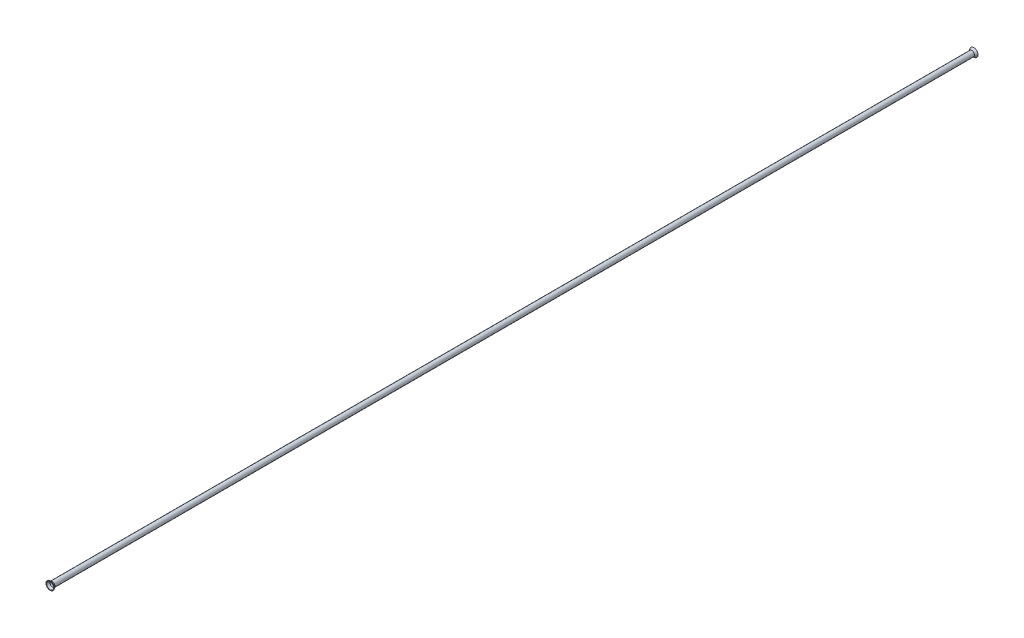
ISO-10303-21;
HEADER;
FILE_DESCRIPTION(('STEP AP214'),'2;1');
FILE_NAME('part.step','',(''),(''),'','','');
FILE_SCHEMA(('AUTOMOTIVE_DESIGN { 1 0 10303 214 1 1 1 1 }'));
ENDSEC;
DATA;
#1=APPLICATION_CONTEXT('core data for automotive mechanical design processes');
#2=APPLICATION_PROTOCOL_DEFINITION('international standard','automotive_design',2000,#1);
#3=PRODUCT_CONTEXT('',#1,'mechanical');
#4=PRODUCT('Part','Part','',(#3));
#5=PRODUCT_RELATED_PRODUCT_CATEGORY('part','',(#4));
#6=PRODUCT_DEFINITION_FORMATION('','',#4);
#7=PRODUCT_DEFINITION_CONTEXT('part definition',#1,'design');
#8=PRODUCT_DEFINITION('design','',#6,#7);
#9=PRODUCT_DEFINITION_SHAPE('','',#8);
#10=(LENGTH_UNIT() NAMED_UNIT(*) SI_UNIT(.MILLI.,.METRE.));
#11=(NAMED_UNIT(*) PLANE_ANGLE_UNIT() SI_UNIT($,.RADIAN.));
#12=(NAMED_UNIT(*) SI_UNIT($,.STERADIAN.) SOLID_ANGLE_UNIT());
#13=UNCERTAINTY_MEASURE_WITH_UNIT(LENGTH_MEASURE(1.E-05),#10,'distance_accuracy_value','');
#14=(GEOMETRIC_REPRESENTATION_CONTEXT(3) GLOBAL_UNCERTAINTY_ASSIGNED_CONTEXT((#13)) GLOBAL_UNIT_ASSIGNED_CONTEXT((#10,
#11,#12)) REPRESENTATION_CONTEXT('',''));
#15=CARTESIAN_POINT('',(0.,0.,0.));
#16=DIRECTION('',(0.,0.,1.));
#17=DIRECTION('',(1.,0.,0.));
#18=AXIS2_PLACEMENT_3D('',#15,#16,#17);
#19=CARTESIAN_POINT('',(0.,0.,-410.5656));
#20=DIRECTION('',(0.,0.,-1.));
#21=DIRECTION('',(1.,0.,0.));
#22=AXIS2_PLACEMENT_3D('',#19,#20,#21);
#23=PLANE('',#22);
#24=CARTESIAN_POINT('',(0.,0.,-410.5656));
#25=DIRECTION('',(0.,0.,-1.));
#26=DIRECTION('',(-1.,0.,0.));
#27=AXIS2_PLACEMENT_3D('',#24,#25,#26);
#28=CIRCLE('',#27,3.72106910108277);
#29=CARTESIAN_POINT('',(-3.72106910108277,0.,-410.5656));
#30=VERTEX_POINT('',#29);
#31=EDGE_CURVE('E53',#30,#30,#28,.F.);
#32=ORIENTED_EDGE('',*,*,#31,.F.);
#33=EDGE_LOOP('',(#32));
#34=FACE_BOUND('',#33,.T.);
#35=CARTESIAN_POINT('',(0.,0.,-410.5656));
#36=DIRECTION('',(0.,0.,1.));
#37=DIRECTION('',(1.,0.,0.));
#38=AXIS2_PLACEMENT_3D('',#35,#36,#37);
#39=CIRCLE('',#38,3.16226910108277);
#40=CARTESIAN_POINT('',(3.16226910108277,0.,-410.5656));
#41=VERTEX_POINT('',#40);
#42=EDGE_CURVE('E59',#41,#41,#39,.F.);
#43=ORIENTED_EDGE('',*,*,#42,.F.);
#44=EDGE_LOOP('',(#43));
#45=FACE_BOUND('',#44,.T.);
#46=ADVANCED_FACE('F33',(#34,#45),#23,.T.);
#47=CARTESIAN_POINT('',(0.,0.,408.7876));
#48=DIRECTION('',(0.,0.,-1.));
#49=DIRECTION('',(-1.,0.,0.));
#50=AXIS2_PLACEMENT_3D('',#47,#48,#49);
#51=CYLINDRICAL_SURFACE('',#50,2.38125);
#52=CARTESIAN_POINT('',(0.,0.,408.7876));
#53=DIRECTION('',(0.,0.,1.));
#54=DIRECTION('',(1.,0.,0.));
#55=AXIS2_PLACEMENT_3D('',#52,#53,#54);
#56=CIRCLE('',#55,2.38125);
#57=CARTESIAN_POINT('',(2.38125,0.,408.7876));
#58=VERTEX_POINT('',#57);
#59=EDGE_CURVE('E10',#58,#58,#56,.T.);
#60=ORIENTED_EDGE('',*,*,#59,.F.);
#61=EDGE_LOOP('',(#60));
#62=FACE_BOUND('',#61,.T.);
#63=CARTESIAN_POINT('',(0.,0.,-408.7876));
#64=DIRECTION('',(0.,0.,1.));
#65=DIRECTION('',(1.,0.,0.));
#66=AXIS2_PLACEMENT_3D('',#63,#64,#65);
#67=CIRCLE('',#66,2.38125);
#68=CARTESIAN_POINT('',(2.38125,0.,-408.7876));
#69=VERTEX_POINT('',#68);
#70=EDGE_CURVE('E56',#69,#69,#67,.T.);
#71=ORIENTED_EDGE('',*,*,#70,.T.);
#72=EDGE_LOOP('',(#71));
#73=FACE_BOUND('',#72,.T.);
#74=ADVANCED_FACE('F35',(#62,#73),#51,.T.);
#75=CARTESIAN_POINT('',(0.,0.,408.7876));
#76=DIRECTION('',(0.,0.,-1.));
#77=DIRECTION('',(-1.,0.,0.));
#78=AXIS2_PLACEMENT_3D('',#75,#76,#77);
#79=CYLINDRICAL_SURFACE('',#78,1.82245);
#80=CARTESIAN_POINT('',(0.,0.,408.7876));
#81=DIRECTION('',(0.,0.,-1.));
#82=DIRECTION('',(-1.,0.,0.));
#83=AXIS2_PLACEMENT_3D('',#80,#81,#82);
#84=CIRCLE('',#83,1.82245);
#85=CARTESIAN_POINT('',(-1.82245,0.,408.7876));
#86=VERTEX_POINT('',#85);
#87=EDGE_CURVE('E48',#86,#86,#84,.T.);
#88=ORIENTED_EDGE('',*,*,#87,.F.);
#89=EDGE_LOOP('',(#88));
#90=FACE_BOUND('',#89,.T.);
#91=CARTESIAN_POINT('',(0.,0.,-408.7876));
#92=DIRECTION('',(0.,0.,-1.));
#93=DIRECTION('',(-1.,0.,0.));
#94=AXIS2_PLACEMENT_3D('',#91,#92,#93);
#95=CIRCLE('',#94,1.82245);
#96=CARTESIAN_POINT('',(-1.82245,0.,-408.7876));
#97=VERTEX_POINT('',#96);
#98=EDGE_CURVE('E62',#97,#97,#95,.T.);
#99=ORIENTED_EDGE('',*,*,#98,.T.);
#100=EDGE_LOOP('',(#99));
#101=FACE_BOUND('',#100,.T.);
#102=ADVANCED_FACE('F66',(#90,#101),#79,.F.);
#103=CARTESIAN_POINT('',(0.,0.,408.7876));
#104=DIRECTION('',(0.,0.,1.));
#105=DIRECTION('',(1.,0.,0.));
#106=AXIS2_PLACEMENT_3D('',#103,#104,#105);
#107=CONICAL_SURFACE('',#106,2.38125,0.645771823237903);
#108=CARTESIAN_POINT('',(0.,0.,410.5656));
#109=DIRECTION('',(0.,0.,1.));
#110=DIRECTION('',(1.,0.,0.));
#111=AXIS2_PLACEMENT_3D('',#108,#109,#110);
#112=CIRCLE('',#111,3.72106910108277);
#113=CARTESIAN_POINT('',(3.72106910108277,0.,410.5656));
#114=VERTEX_POINT('',#113);
#115=EDGE_CURVE('E40',#114,#114,#112,.T.);
#116=ORIENTED_EDGE('',*,*,#115,.F.);
#117=EDGE_LOOP('',(#116));
#118=FACE_BOUND('',#117,.T.);
#119=ORIENTED_EDGE('',*,*,#59,.T.);
#120=EDGE_LOOP('',(#119));
#121=FACE_BOUND('',#120,.T.);
#122=ADVANCED_FACE('F95',(#118,#121),#107,.T.);
#123=CARTESIAN_POINT('',(0.,0.,410.5656));
#124=DIRECTION('',(0.,0.,1.));
#125=DIRECTION('',(1.,0.,0.));
#126=AXIS2_PLACEMENT_3D('',#123,#124,#125);
#127=PLANE('',#126);
#128=CARTESIAN_POINT('',(0.,0.,410.5656));
#129=DIRECTION('',(0.,0.,-1.));
#130=DIRECTION('',(-1.,0.,0.));
#131=AXIS2_PLACEMENT_3D('',#128,#129,#130);
#132=CIRCLE('',#131,3.16226910108277);
#133=CARTESIAN_POINT('',(-3.16226910108277,0.,410.5656));
#134=VERTEX_POINT('',#133);
#135=EDGE_CURVE('E44',#134,#134,#132,.T.);
#136=ORIENTED_EDGE('',*,*,#135,.T.);
#137=EDGE_LOOP('',(#136));
#138=FACE_BOUND('',#137,.T.);
#139=ORIENTED_EDGE('',*,*,#115,.T.);
#140=EDGE_LOOP('',(#139));
#141=FACE_BOUND('',#140,.T.);
#142=ADVANCED_FACE('F91',(#138,#141),#127,.T.);
#143=CARTESIAN_POINT('',(0.,0.,408.7876));
#144=DIRECTION('',(0.,0.,1.));
#145=DIRECTION('',(-1.,0.,0.));
#146=AXIS2_PLACEMENT_3D('',#143,#144,#145);
#147=CONICAL_SURFACE('',#146,1.82245,0.645771823237903);
#148=ORIENTED_EDGE('',*,*,#135,.F.);
#149=EDGE_LOOP('',(#148));
#150=FACE_BOUND('',#149,.T.);
#151=ORIENTED_EDGE('',*,*,#87,.T.);
#152=EDGE_LOOP('',(#151));
#153=FACE_BOUND('',#152,.T.);
#154=ADVANCED_FACE('F76',(#150,#153),#147,.F.);
#155=CARTESIAN_POINT('',(0.,0.,-408.7876));
#156=DIRECTION('',(0.,0.,-1.));
#157=DIRECTION('',(1.,0.,0.));
#158=AXIS2_PLACEMENT_3D('',#155,#156,#157);
#159=CONICAL_SURFACE('',#158,2.38125,0.645771823237903);
#160=ORIENTED_EDGE('',*,*,#31,.T.);
#161=EDGE_LOOP('',(#160));
#162=FACE_BOUND('',#161,.T.);
#163=ORIENTED_EDGE('',*,*,#70,.F.);
#164=EDGE_LOOP('',(#163));
#165=FACE_BOUND('',#164,.T.);
#166=ADVANCED_FACE('F70',(#162,#165),#159,.T.);
#167=CARTESIAN_POINT('',(0.,0.,-408.7876));
#168=DIRECTION('',(0.,0.,-1.));
#169=DIRECTION('',(-1.,0.,0.));
#170=AXIS2_PLACEMENT_3D('',#167,#168,#169);
#171=CONICAL_SURFACE('',#170,1.82245,0.645771823237903);
#172=ORIENTED_EDGE('',*,*,#42,.T.);
#173=EDGE_LOOP('',(#172));
#174=FACE_BOUND('',#173,.T.);
#175=ORIENTED_EDGE('',*,*,#98,.F.);
#176=EDGE_LOOP('',(#175));
#177=FACE_BOUND('',#176,.T.);
#178=ADVANCED_FACE('F68',(#174,#177),#171,.F.);
#179=CLOSED_SHELL('',(#46,#74,#102,#122,#142,#154,#166,#178));
#180=MANIFOLD_SOLID_BREP('B2',#179);
#181=ADVANCED_BREP_SHAPE_REPRESENTATION('',(#18,#180),#14);
#182=SHAPE_DEFINITION_REPRESENTATION(#9,#181);
ENDSEC;
END-ISO-10303-21;
